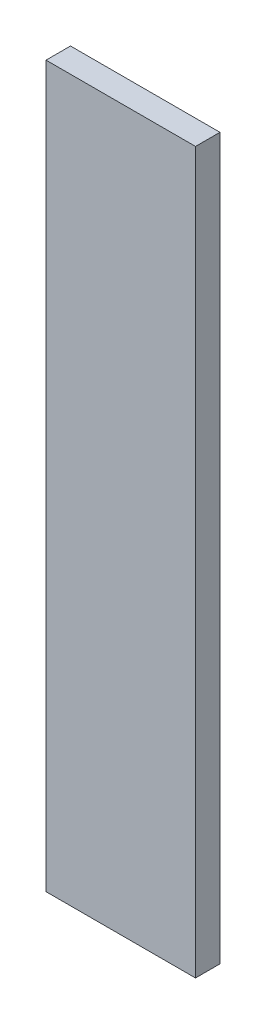
ISO-10303-21;
HEADER;
FILE_DESCRIPTION(('STEP AP214'),'2;1');
FILE_NAME('part.step','',(''),(''),'','','');
FILE_SCHEMA(('AUTOMOTIVE_DESIGN { 1 0 10303 214 1 1 1 1 }'));
ENDSEC;
DATA;
#1=APPLICATION_CONTEXT('core data for automotive mechanical design processes');
#2=APPLICATION_PROTOCOL_DEFINITION('international standard','automotive_design',2000,#1);
#3=PRODUCT_CONTEXT('',#1,'mechanical');
#4=PRODUCT('Part','Part','',(#3));
#5=PRODUCT_RELATED_PRODUCT_CATEGORY('part','',(#4));
#6=PRODUCT_DEFINITION_FORMATION('','',#4);
#7=PRODUCT_DEFINITION_CONTEXT('part definition',#1,'design');
#8=PRODUCT_DEFINITION('design','',#6,#7);
#9=PRODUCT_DEFINITION_SHAPE('','',#8);
#10=(LENGTH_UNIT() NAMED_UNIT(*) SI_UNIT(.MILLI.,.METRE.));
#11=(NAMED_UNIT(*) PLANE_ANGLE_UNIT() SI_UNIT($,.RADIAN.));
#12=(NAMED_UNIT(*) SI_UNIT($,.STERADIAN.) SOLID_ANGLE_UNIT());
#13=UNCERTAINTY_MEASURE_WITH_UNIT(LENGTH_MEASURE(1.E-05),#10,'distance_accuracy_value','');
#14=(GEOMETRIC_REPRESENTATION_CONTEXT(3) GLOBAL_UNCERTAINTY_ASSIGNED_CONTEXT((#13)) GLOBAL_UNIT_ASSIGNED_CONTEXT((#10,
#11,#12)) REPRESENTATION_CONTEXT('',''));
#15=CARTESIAN_POINT('',(0.,0.,0.));
#16=DIRECTION('',(0.,0.,1.));
#17=DIRECTION('',(1.,0.,0.));
#18=AXIS2_PLACEMENT_3D('',#15,#16,#17);
#19=CARTESIAN_POINT('',(54.9999999999999,265.,18.));
#20=DIRECTION('',(-1.,0.,0.));
#21=DIRECTION('',(0.,-1.,0.));
#22=AXIS2_PLACEMENT_3D('',#19,#20,#21);
#23=PLANE('',#22);
#24=DIRECTION('',(0.,1.,0.));
#25=VECTOR('',#24,1.);
#26=CARTESIAN_POINT('',(54.9999999999999,265.,0.));
#27=LINE('',#26,#25);
#28=CARTESIAN_POINT('',(55.,-265.,0.));
#29=VERTEX_POINT('',#28);
#30=CARTESIAN_POINT('',(54.9999999999999,265.,0.));
#31=VERTEX_POINT('',#30);
#32=EDGE_CURVE('E96',#29,#31,#27,.T.);
#33=ORIENTED_EDGE('',*,*,#32,.T.);
#34=DIRECTION('',(0.,0.,-1.));
#35=VECTOR('',#34,1.);
#36=CARTESIAN_POINT('',(54.9999999999999,265.,18.));
#37=LINE('',#36,#35);
#38=CARTESIAN_POINT('',(54.9999999999999,265.,18.));
#39=VERTEX_POINT('',#38);
#40=EDGE_CURVE('E11',#39,#31,#37,.T.);
#41=ORIENTED_EDGE('',*,*,#40,.F.);
#42=DIRECTION('',(0.,1.,0.));
#43=VECTOR('',#42,1.);
#44=CARTESIAN_POINT('',(54.9999999999999,265.,18.));
#45=LINE('',#44,#43);
#46=CARTESIAN_POINT('',(55.,-265.,18.));
#47=VERTEX_POINT('',#46);
#48=EDGE_CURVE('E84',#47,#39,#45,.T.);
#49=ORIENTED_EDGE('',*,*,#48,.F.);
#50=DIRECTION('',(0.,0.,-1.));
#51=VECTOR('',#50,1.);
#52=CARTESIAN_POINT('',(55.,-265.,18.));
#53=LINE('',#52,#51);
#54=EDGE_CURVE('E92',#47,#29,#53,.T.);
#55=ORIENTED_EDGE('',*,*,#54,.T.);
#56=EDGE_LOOP('',(#33,#41,#49,#55));
#57=FACE_BOUND('',#56,.T.);
#58=ADVANCED_FACE('F33',(#57),#23,.F.);
#59=CARTESIAN_POINT('',(-55.0000000000001,265.,18.));
#60=DIRECTION('',(0.,-1.,0.));
#61=DIRECTION('',(0.,0.,-1.));
#62=AXIS2_PLACEMENT_3D('',#59,#60,#61);
#63=PLANE('',#62);
#64=DIRECTION('',(-1.,0.,0.));
#65=VECTOR('',#64,1.);
#66=CARTESIAN_POINT('',(-55.0000000000001,265.,0.));
#67=LINE('',#66,#65);
#68=CARTESIAN_POINT('',(-55.0000000000001,265.,0.));
#69=VERTEX_POINT('',#68);
#70=EDGE_CURVE('E88',#31,#69,#67,.T.);
#71=ORIENTED_EDGE('',*,*,#70,.T.);
#72=DIRECTION('',(0.,0.,-1.));
#73=VECTOR('',#72,1.);
#74=CARTESIAN_POINT('',(-55.0000000000001,265.,18.));
#75=LINE('',#74,#73);
#76=CARTESIAN_POINT('',(-55.0000000000001,265.,18.));
#77=VERTEX_POINT('',#76);
#78=EDGE_CURVE('E41',#77,#69,#75,.T.);
#79=ORIENTED_EDGE('',*,*,#78,.F.);
#80=DIRECTION('',(-1.,0.,0.));
#81=VECTOR('',#80,1.);
#82=CARTESIAN_POINT('',(-55.0000000000001,265.,18.));
#83=LINE('',#82,#81);
#84=EDGE_CURVE('E79',#39,#77,#83,.T.);
#85=ORIENTED_EDGE('',*,*,#84,.F.);
#86=ORIENTED_EDGE('',*,*,#40,.T.);
#87=EDGE_LOOP('',(#71,#79,#85,#86));
#88=FACE_BOUND('',#87,.T.);
#89=ADVANCED_FACE('F87',(#88),#63,.F.);
#90=CARTESIAN_POINT('',(-55.0000000000001,265.,18.));
#91=DIRECTION('',(1.,0.,0.));
#92=DIRECTION('',(0.,1.,0.));
#93=AXIS2_PLACEMENT_3D('',#90,#91,#92);
#94=PLANE('',#93);
#95=DIRECTION('',(0.,-1.,0.));
#96=VECTOR('',#95,1.);
#97=CARTESIAN_POINT('',(-55.0000000000001,265.,0.));
#98=LINE('',#97,#96);
#99=CARTESIAN_POINT('',(-55.,-265.,0.));
#100=VERTEX_POINT('',#99);
#101=EDGE_CURVE('E66',#69,#100,#98,.T.);
#102=ORIENTED_EDGE('',*,*,#101,.T.);
#103=DIRECTION('',(0.,0.,-1.));
#104=VECTOR('',#103,1.);
#105=CARTESIAN_POINT('',(-55.,-265.,18.));
#106=LINE('',#105,#104);
#107=CARTESIAN_POINT('',(-55.,-265.,18.));
#108=VERTEX_POINT('',#107);
#109=EDGE_CURVE('E89',#108,#100,#106,.T.);
#110=ORIENTED_EDGE('',*,*,#109,.F.);
#111=DIRECTION('',(0.,-1.,0.));
#112=VECTOR('',#111,1.);
#113=CARTESIAN_POINT('',(-55.0000000000001,265.,18.));
#114=LINE('',#113,#112);
#115=EDGE_CURVE('E82',#77,#108,#114,.T.);
#116=ORIENTED_EDGE('',*,*,#115,.F.);
#117=ORIENTED_EDGE('',*,*,#78,.T.);
#118=EDGE_LOOP('',(#102,#110,#116,#117));
#119=FACE_BOUND('',#118,.T.);
#120=ADVANCED_FACE('F90',(#119),#94,.F.);
#121=CARTESIAN_POINT('',(-55.,-265.,18.));
#122=DIRECTION('',(0.,1.,0.));
#123=DIRECTION('',(0.,0.,1.));
#124=AXIS2_PLACEMENT_3D('',#121,#122,#123);
#125=PLANE('',#124);
#126=DIRECTION('',(1.,0.,0.));
#127=VECTOR('',#126,1.);
#128=CARTESIAN_POINT('',(-55.,-265.,0.));
#129=LINE('',#128,#127);
#130=EDGE_CURVE('E72',#100,#29,#129,.T.);
#131=ORIENTED_EDGE('',*,*,#130,.T.);
#132=ORIENTED_EDGE('',*,*,#54,.F.);
#133=DIRECTION('',(1.,0.,0.));
#134=VECTOR('',#133,1.);
#135=CARTESIAN_POINT('',(-55.,-265.,18.));
#136=LINE('',#135,#134);
#137=EDGE_CURVE('E49',#108,#47,#136,.T.);
#138=ORIENTED_EDGE('',*,*,#137,.F.);
#139=ORIENTED_EDGE('',*,*,#109,.T.);
#140=EDGE_LOOP('',(#131,#132,#138,#139));
#141=FACE_BOUND('',#140,.T.);
#142=ADVANCED_FACE('F103',(#141),#125,.F.);
#143=CARTESIAN_POINT('',(0.,0.,18.));
#144=DIRECTION('',(0.,0.,1.));
#145=DIRECTION('',(1.,0.,0.));
#146=AXIS2_PLACEMENT_3D('',#143,#144,#145);
#147=PLANE('',#146);
#148=ORIENTED_EDGE('',*,*,#48,.T.);
#149=ORIENTED_EDGE('',*,*,#84,.T.);
#150=ORIENTED_EDGE('',*,*,#115,.T.);
#151=ORIENTED_EDGE('',*,*,#137,.T.);
#152=EDGE_LOOP('',(#148,#149,#150,#151));
#153=FACE_BOUND('',#152,.T.);
#154=ADVANCED_FACE('F80',(#153),#147,.T.);
#155=CARTESIAN_POINT('',(0.,0.,0.));
#156=DIRECTION('',(0.,0.,1.));
#157=DIRECTION('',(1.,0.,0.));
#158=AXIS2_PLACEMENT_3D('',#155,#156,#157);
#159=PLANE('',#158);
#160=ORIENTED_EDGE('',*,*,#32,.F.);
#161=ORIENTED_EDGE('',*,*,#130,.F.);
#162=ORIENTED_EDGE('',*,*,#101,.F.);
#163=ORIENTED_EDGE('',*,*,#70,.F.);
#164=EDGE_LOOP('',(#160,#161,#162,#163));
#165=FACE_BOUND('',#164,.T.);
#166=ADVANCED_FACE('F106',(#165),#159,.F.);
#167=CLOSED_SHELL('',(#58,#89,#120,#142,#154,#166));
#168=MANIFOLD_SOLID_BREP('B2',#167);
#169=ADVANCED_BREP_SHAPE_REPRESENTATION('',(#18,#168),#14);
#170=SHAPE_DEFINITION_REPRESENTATION(#9,#169);
ENDSEC;
END-ISO-10303-21;
